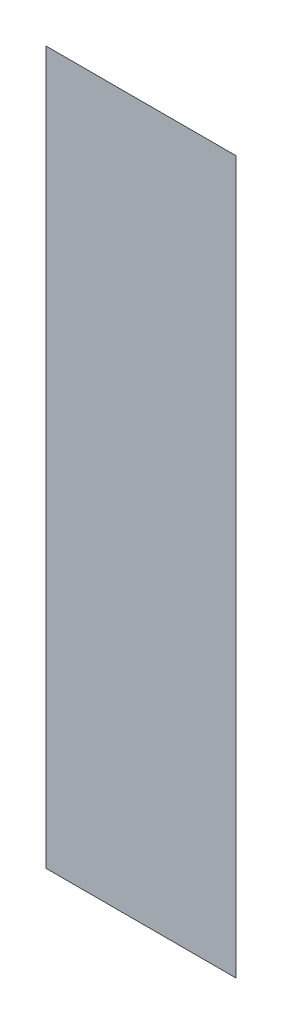
ISO-10303-21;
HEADER;
FILE_DESCRIPTION(('STEP AP214'),'2;1');
FILE_NAME('part.step','',(''),(''),'','','');
FILE_SCHEMA(('AUTOMOTIVE_DESIGN { 1 0 10303 214 1 1 1 1 }'));
ENDSEC;
DATA;
#1=APPLICATION_CONTEXT('core data for automotive mechanical design processes');
#2=APPLICATION_PROTOCOL_DEFINITION('international standard','automotive_design',2000,#1);
#3=PRODUCT_CONTEXT('',#1,'mechanical');
#4=PRODUCT('Part','Part','',(#3));
#5=PRODUCT_RELATED_PRODUCT_CATEGORY('part','',(#4));
#6=PRODUCT_DEFINITION_FORMATION('','',#4);
#7=PRODUCT_DEFINITION_CONTEXT('part definition',#1,'design');
#8=PRODUCT_DEFINITION('design','',#6,#7);
#9=PRODUCT_DEFINITION_SHAPE('','',#8);
#10=(LENGTH_UNIT() NAMED_UNIT(*) SI_UNIT(.MILLI.,.METRE.));
#11=(NAMED_UNIT(*) PLANE_ANGLE_UNIT() SI_UNIT($,.RADIAN.));
#12=(NAMED_UNIT(*) SI_UNIT($,.STERADIAN.) SOLID_ANGLE_UNIT());
#13=UNCERTAINTY_MEASURE_WITH_UNIT(LENGTH_MEASURE(1.E-05),#10,'distance_accuracy_value','');
#14=(GEOMETRIC_REPRESENTATION_CONTEXT(3) GLOBAL_UNCERTAINTY_ASSIGNED_CONTEXT((#13)) GLOBAL_UNIT_ASSIGNED_CONTEXT((#10,
#11,#12)) REPRESENTATION_CONTEXT('',''));
#15=CARTESIAN_POINT('',(0.,0.,0.));
#16=DIRECTION('',(0.,0.,1.));
#17=DIRECTION('',(1.,0.,0.));
#18=AXIS2_PLACEMENT_3D('',#15,#16,#17);
#19=CARTESIAN_POINT('',(0.169413095143196,-0.696741706193788,0.0889425196850394));
#20=DIRECTION('',(0.,0.,1.));
#21=DIRECTION('',(0.,-1.,0.));
#22=AXIS2_PLACEMENT_3D('',#19,#20,#21);
#23=PLANE('',#22);
#24=CARTESIAN_POINT('',(0.158830417977842,-0.698631469973316,0.0889425196850394));
#25=DIRECTION('',(1.,0.,0.));
#26=VECTOR('',#25,1.);
#27=LINE('',#24,#26);
#28=CARTESIAN_POINT('',(0.158830417977842,-0.698631469973316,0.0890685039370079));
#29=VERTEX_POINT('',#28);
#30=CARTESIAN_POINT('',(0.168909158135323,-0.698631469973316,0.0890685039370079));
#31=VERTEX_POINT('',#30);
#32=EDGE_CURVE('E50',#29,#31,#27,.T.);
#33=ORIENTED_EDGE('',*,*,#32,.T.);
#34=CARTESIAN_POINT('',(0.168909158135323,-0.698631469973316,0.0889425196850394));
#35=DIRECTION('',(0.,-1.,0.));
#36=VECTOR('',#35,1.);
#37=LINE('',#34,#36);
#38=CARTESIAN_POINT('',(0.168909158135323,-0.736426745563867,0.0890685039370079));
#39=VERTEX_POINT('',#38);
#40=EDGE_CURVE('E28',#31,#39,#37,.T.);
#41=ORIENTED_EDGE('',*,*,#40,.T.);
#42=CARTESIAN_POINT('',(0.168909158135323,-0.736426745563867,0.0889425196850394));
#43=DIRECTION('',(-1.,0.,0.));
#44=VECTOR('',#43,1.);
#45=LINE('',#42,#44);
#46=CARTESIAN_POINT('',(0.158830417977842,-0.736426745563867,0.0890685039370079));
#47=VERTEX_POINT('',#46);
#48=EDGE_CURVE('E11',#39,#47,#45,.T.);
#49=ORIENTED_EDGE('',*,*,#48,.T.);
#50=CARTESIAN_POINT('',(0.158830417977842,-0.736426745563867,0.0889425196850394));
#51=DIRECTION('',(0.,1.,0.));
#52=VECTOR('',#51,1.);
#53=LINE('',#50,#52);
#54=EDGE_CURVE('E41',#47,#29,#53,.T.);
#55=ORIENTED_EDGE('',*,*,#54,.T.);
#56=EDGE_LOOP('',(#33,#41,#49,#55));
#57=FACE_BOUND('',#56,.T.);
#58=ADVANCED_FACE('F17',(#57),#23,.F.);
#59=CARTESIAN_POINT('',(0.169413095143196,-0.696741706193788,0.0891944881889764));
#60=DIRECTION('',(0.,0.,1.));
#61=DIRECTION('',(0.,-1.,0.));
#62=AXIS2_PLACEMENT_3D('',#59,#60,#61);
#63=PLANE('',#62);
#64=ORIENTED_EDGE('',*,*,#40,.F.);
#65=ORIENTED_EDGE('',*,*,#32,.F.);
#66=ORIENTED_EDGE('',*,*,#54,.F.);
#67=ORIENTED_EDGE('',*,*,#48,.F.);
#68=EDGE_LOOP('',(#64,#65,#66,#67));
#69=FACE_BOUND('',#68,.T.);
#70=ADVANCED_FACE('F49',(#69),#63,.T.);
#71=CLOSED_SHELL('',(#58,#70));
#72=MANIFOLD_SOLID_BREP('B1',#71);
#73=ADVANCED_BREP_SHAPE_REPRESENTATION('',(#18,#72),#14);
#74=SHAPE_DEFINITION_REPRESENTATION(#9,#73);
ENDSEC;
END-ISO-10303-21;
